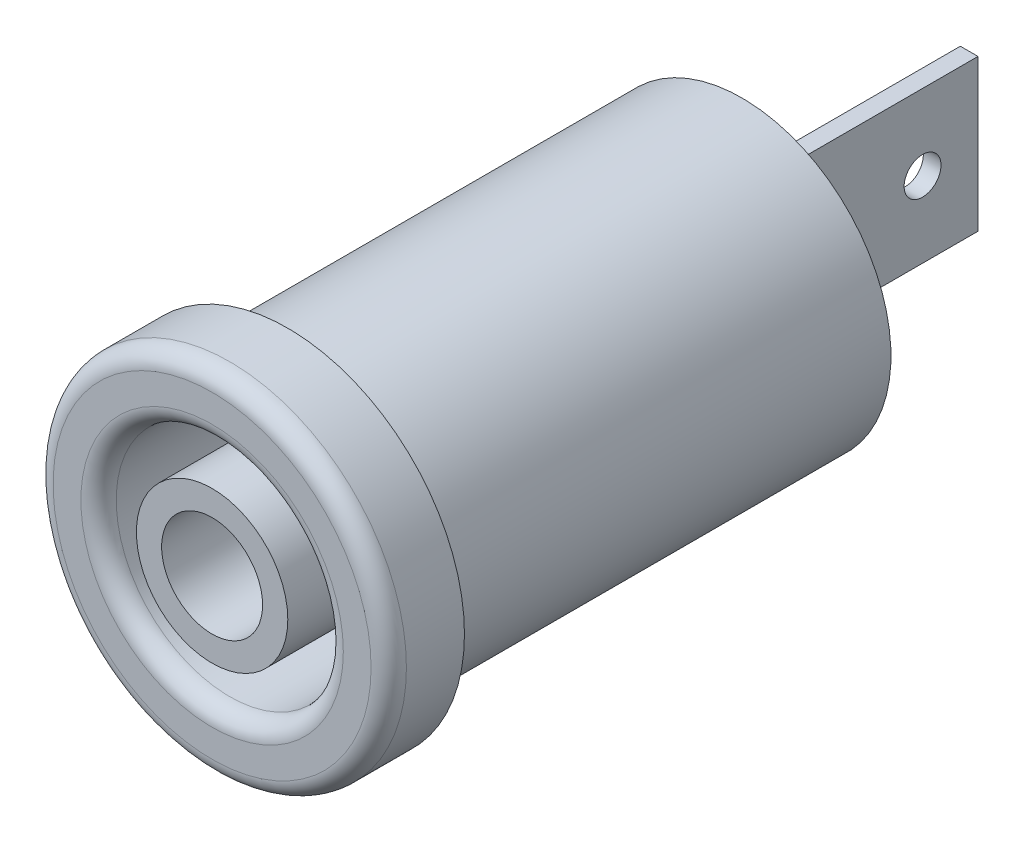
ISO-10303-21;
HEADER;
FILE_DESCRIPTION(('STEP AP214'),'2;1');
FILE_NAME('part.step','',(''),(''),'','','');
FILE_SCHEMA(('AUTOMOTIVE_DESIGN { 1 0 10303 214 1 1 1 1 }'));
ENDSEC;
DATA;
#1=APPLICATION_CONTEXT('core data for automotive mechanical design processes');
#2=APPLICATION_PROTOCOL_DEFINITION('international standard','automotive_design',2000,#1);
#3=PRODUCT_CONTEXT('',#1,'mechanical');
#4=PRODUCT('Part','Part','',(#3));
#5=PRODUCT_RELATED_PRODUCT_CATEGORY('part','',(#4));
#6=PRODUCT_DEFINITION_FORMATION('','',#4);
#7=PRODUCT_DEFINITION_CONTEXT('part definition',#1,'design');
#8=PRODUCT_DEFINITION('design','',#6,#7);
#9=PRODUCT_DEFINITION_SHAPE('','',#8);
#10=(LENGTH_UNIT() NAMED_UNIT(*) SI_UNIT(.MILLI.,.METRE.));
#11=(NAMED_UNIT(*) PLANE_ANGLE_UNIT() SI_UNIT($,.RADIAN.));
#12=(NAMED_UNIT(*) SI_UNIT($,.STERADIAN.) SOLID_ANGLE_UNIT());
#13=UNCERTAINTY_MEASURE_WITH_UNIT(LENGTH_MEASURE(1.E-05),#10,'distance_accuracy_value','');
#14=(GEOMETRIC_REPRESENTATION_CONTEXT(3) GLOBAL_UNCERTAINTY_ASSIGNED_CONTEXT((#13)) GLOBAL_UNIT_ASSIGNED_CONTEXT((#10,
#11,#12)) REPRESENTATION_CONTEXT('',''));
#15=CARTESIAN_POINT('',(0.,0.,0.));
#16=DIRECTION('',(0.,0.,1.));
#17=DIRECTION('',(1.,0.,0.));
#18=AXIS2_PLACEMENT_3D('',#15,#16,#17);
#19=CARTESIAN_POINT('',(0.,0.,-18.));
#20=DIRECTION('',(0.,0.,-1.));
#21=DIRECTION('',(-1.,0.,0.));
#22=AXIS2_PLACEMENT_3D('',#19,#20,#21);
#23=PLANE('',#22);
#24=CARTESIAN_POINT('',(0.,0.,-18.));
#25=DIRECTION('',(0.,0.,-1.));
#26=DIRECTION('',(-1.,0.,0.));
#27=AXIS2_PLACEMENT_3D('',#24,#25,#26);
#28=CIRCLE('',#27,5.9);
#29=CARTESIAN_POINT('',(-5.9,0.,-18.));
#30=VERTEX_POINT('',#29);
#31=EDGE_CURVE('E120',#30,#30,#28,.T.);
#32=ORIENTED_EDGE('',*,*,#31,.T.);
#33=EDGE_LOOP('',(#32));
#34=FACE_BOUND('',#33,.T.);
#35=DIRECTION('',(1.,0.,0.));
#36=VECTOR('',#35,1.);
#37=CARTESIAN_POINT('',(0.35,3.,-18.));
#38=LINE('',#37,#36);
#39=CARTESIAN_POINT('',(-0.35,3.,-18.));
#40=VERTEX_POINT('',#39);
#41=CARTESIAN_POINT('',(0.35,3.,-18.));
#42=VERTEX_POINT('',#41);
#43=EDGE_CURVE('E98',#40,#42,#38,.T.);
#44=ORIENTED_EDGE('',*,*,#43,.F.);
#45=DIRECTION('',(0.,1.,0.));
#46=VECTOR('',#45,1.);
#47=CARTESIAN_POINT('',(-0.35,3.,-18.));
#48=LINE('',#47,#46);
#49=CARTESIAN_POINT('',(-0.35,-3.,-18.));
#50=VERTEX_POINT('',#49);
#51=EDGE_CURVE('E109',#50,#40,#48,.T.);
#52=ORIENTED_EDGE('',*,*,#51,.F.);
#53=DIRECTION('',(-1.,0.,0.));
#54=VECTOR('',#53,1.);
#55=CARTESIAN_POINT('',(0.35,-3.,-18.));
#56=LINE('',#55,#54);
#57=CARTESIAN_POINT('',(0.35,-3.,-18.));
#58=VERTEX_POINT('',#57);
#59=EDGE_CURVE('E79',#58,#50,#56,.T.);
#60=ORIENTED_EDGE('',*,*,#59,.F.);
#61=DIRECTION('',(0.,-1.,0.));
#62=VECTOR('',#61,1.);
#63=CARTESIAN_POINT('',(0.35,3.,-18.));
#64=LINE('',#63,#62);
#65=EDGE_CURVE('E114',#42,#58,#64,.T.);
#66=ORIENTED_EDGE('',*,*,#65,.F.);
#67=EDGE_LOOP('',(#44,#52,#60,#66));
#68=FACE_BOUND('',#67,.T.);
#69=ADVANCED_FACE('F42',(#34,#68),#23,.T.);
#70=CARTESIAN_POINT('',(0.,0.,3.));
#71=DIRECTION('',(0.,0.,-1.));
#72=DIRECTION('',(-1.,0.,0.));
#73=AXIS2_PLACEMENT_3D('',#70,#71,#72);
#74=CYLINDRICAL_SURFACE('',#73,7.);
#75=CARTESIAN_POINT('',(0.,0.,2.3));
#76=DIRECTION('',(0.,0.,1.));
#77=DIRECTION('',(1.,0.,0.));
#78=AXIS2_PLACEMENT_3D('',#75,#76,#77);
#79=CIRCLE('',#78,7.);
#80=CARTESIAN_POINT('',(7.,0.,2.3));
#81=VERTEX_POINT('',#80);
#82=EDGE_CURVE('E11',#81,#81,#79,.F.);
#83=ORIENTED_EDGE('',*,*,#82,.T.);
#84=EDGE_LOOP('',(#83));
#85=FACE_BOUND('',#84,.T.);
#86=CARTESIAN_POINT('',(0.,0.,0.));
#87=DIRECTION('',(0.,0.,1.));
#88=DIRECTION('',(1.,0.,0.));
#89=AXIS2_PLACEMENT_3D('',#86,#87,#88);
#90=CIRCLE('',#89,7.);
#91=CARTESIAN_POINT('',(7.,0.,0.));
#92=VERTEX_POINT('',#91);
#93=EDGE_CURVE('E123',#92,#92,#90,.T.);
#94=ORIENTED_EDGE('',*,*,#93,.T.);
#95=EDGE_LOOP('',(#94));
#96=FACE_BOUND('',#95,.T.);
#97=ADVANCED_FACE('F187',(#85,#96),#74,.T.);
#98=CARTESIAN_POINT('',(0.,0.,3.));
#99=DIRECTION('',(0.,0.,1.));
#100=DIRECTION('',(1.,0.,0.));
#101=AXIS2_PLACEMENT_3D('',#98,#99,#100);
#102=PLANE('',#101);
#103=CARTESIAN_POINT('',(0.,0.,3.));
#104=DIRECTION('',(0.,0.,1.));
#105=DIRECTION('',(1.,0.,0.));
#106=AXIS2_PLACEMENT_3D('',#103,#104,#105);
#107=CIRCLE('',#106,5.2);
#108=CARTESIAN_POINT('',(5.2,0.,3.));
#109=VERTEX_POINT('',#108);
#110=EDGE_CURVE('E50',#109,#109,#107,.F.);
#111=ORIENTED_EDGE('',*,*,#110,.T.);
#112=EDGE_LOOP('',(#111));
#113=FACE_BOUND('',#112,.T.);
#114=CARTESIAN_POINT('',(0.,0.,3.));
#115=DIRECTION('',(0.,0.,1.));
#116=DIRECTION('',(1.,0.,0.));
#117=AXIS2_PLACEMENT_3D('',#114,#115,#116);
#118=CIRCLE('',#117,6.3);
#119=CARTESIAN_POINT('',(6.3,0.,3.));
#120=VERTEX_POINT('',#119);
#121=EDGE_CURVE('E132',#120,#120,#118,.T.);
#122=ORIENTED_EDGE('',*,*,#121,.T.);
#123=EDGE_LOOP('',(#122));
#124=FACE_BOUND('',#123,.T.);
#125=ADVANCED_FACE('F137',(#113,#124),#102,.T.);
#126=CARTESIAN_POINT('',(0.,0.,0.));
#127=DIRECTION('',(0.,0.,1.));
#128=DIRECTION('',(1.,0.,0.));
#129=AXIS2_PLACEMENT_3D('',#126,#127,#128);
#130=PLANE('',#129);
#131=CARTESIAN_POINT('',(0.,0.,0.));
#132=DIRECTION('',(0.,0.,-1.));
#133=DIRECTION('',(-1.,0.,0.));
#134=AXIS2_PLACEMENT_3D('',#131,#132,#133);
#135=CIRCLE('',#134,5.9);
#136=CARTESIAN_POINT('',(-5.9,0.,0.));
#137=VERTEX_POINT('',#136);
#138=EDGE_CURVE('E124',#137,#137,#135,.T.);
#139=ORIENTED_EDGE('',*,*,#138,.F.);
#140=EDGE_LOOP('',(#139));
#141=FACE_BOUND('',#140,.T.);
#142=ORIENTED_EDGE('',*,*,#93,.F.);
#143=EDGE_LOOP('',(#142));
#144=FACE_BOUND('',#143,.T.);
#145=ADVANCED_FACE('F201',(#141,#144),#130,.F.);
#146=CARTESIAN_POINT('',(0.,0.,-18.));
#147=DIRECTION('',(0.,0.,1.));
#148=DIRECTION('',(1.,0.,0.));
#149=AXIS2_PLACEMENT_3D('',#146,#147,#148);
#150=CYLINDRICAL_SURFACE('',#149,5.9);
#151=ORIENTED_EDGE('',*,*,#31,.F.);
#152=EDGE_LOOP('',(#151));
#153=FACE_BOUND('',#152,.T.);
#154=ORIENTED_EDGE('',*,*,#138,.T.);
#155=EDGE_LOOP('',(#154));
#156=FACE_BOUND('',#155,.T.);
#157=ADVANCED_FACE('F198',(#153,#156),#150,.T.);
#158=CARTESIAN_POINT('',(-0.35,3.,-27.));
#159=DIRECTION('',(1.,0.,0.));
#160=DIRECTION('',(0.,0.,-1.));
#161=AXIS2_PLACEMENT_3D('',#158,#159,#160);
#162=PLANE('',#161);
#163=CARTESIAN_POINT('',(-0.35,0.,-24.8027620544737));
#164=DIRECTION('',(1.,0.,0.));
#165=DIRECTION('',(0.,0.,-1.));
#166=AXIS2_PLACEMENT_3D('',#163,#164,#165);
#167=CIRCLE('',#166,0.730989372443443);
#168=CARTESIAN_POINT('',(-0.35,0.,-25.5337514269172));
#169=VERTEX_POINT('',#168);
#170=EDGE_CURVE('E112',#169,#169,#167,.T.);
#171=ORIENTED_EDGE('',*,*,#170,.T.);
#172=EDGE_LOOP('',(#171));
#173=FACE_BOUND('',#172,.T.);
#174=ORIENTED_EDGE('',*,*,#51,.T.);
#175=DIRECTION('',(0.,0.,1.));
#176=VECTOR('',#175,1.);
#177=CARTESIAN_POINT('',(-0.35,3.,-27.));
#178=LINE('',#177,#176);
#179=CARTESIAN_POINT('',(-0.35,3.,-27.));
#180=VERTEX_POINT('',#179);
#181=EDGE_CURVE('E101',#180,#40,#178,.T.);
#182=ORIENTED_EDGE('',*,*,#181,.F.);
#183=DIRECTION('',(0.,1.,0.));
#184=VECTOR('',#183,1.);
#185=CARTESIAN_POINT('',(-0.35,3.,-27.));
#186=LINE('',#185,#184);
#187=CARTESIAN_POINT('',(-0.35,-3.,-27.));
#188=VERTEX_POINT('',#187);
#189=EDGE_CURVE('E91',#188,#180,#186,.T.);
#190=ORIENTED_EDGE('',*,*,#189,.F.);
#191=DIRECTION('',(0.,0.,1.));
#192=VECTOR('',#191,1.);
#193=CARTESIAN_POINT('',(-0.35,-3.,-27.));
#194=LINE('',#193,#192);
#195=EDGE_CURVE('E105',#188,#50,#194,.T.);
#196=ORIENTED_EDGE('',*,*,#195,.T.);
#197=EDGE_LOOP('',(#174,#182,#190,#196));
#198=FACE_BOUND('',#197,.T.);
#199=ADVANCED_FACE('F169',(#173,#198),#162,.F.);
#200=CARTESIAN_POINT('',(0.35,3.,-27.));
#201=DIRECTION('',(0.,-1.,0.));
#202=DIRECTION('',(0.,0.,-1.));
#203=AXIS2_PLACEMENT_3D('',#200,#201,#202);
#204=PLANE('',#203);
#205=ORIENTED_EDGE('',*,*,#43,.T.);
#206=DIRECTION('',(0.,0.,1.));
#207=VECTOR('',#206,1.);
#208=CARTESIAN_POINT('',(0.35,3.,-27.));
#209=LINE('',#208,#207);
#210=CARTESIAN_POINT('',(0.35,3.,-27.));
#211=VERTEX_POINT('',#210);
#212=EDGE_CURVE('E95',#211,#42,#209,.T.);
#213=ORIENTED_EDGE('',*,*,#212,.F.);
#214=DIRECTION('',(1.,0.,0.));
#215=VECTOR('',#214,1.);
#216=CARTESIAN_POINT('',(0.35,3.,-27.));
#217=LINE('',#216,#215);
#218=EDGE_CURVE('E86',#180,#211,#217,.T.);
#219=ORIENTED_EDGE('',*,*,#218,.F.);
#220=ORIENTED_EDGE('',*,*,#181,.T.);
#221=EDGE_LOOP('',(#205,#213,#219,#220));
#222=FACE_BOUND('',#221,.T.);
#223=ADVANCED_FACE('F96',(#222),#204,.F.);
#224=CARTESIAN_POINT('',(0.35,3.,-27.));
#225=DIRECTION('',(-1.,0.,0.));
#226=DIRECTION('',(0.,0.,1.));
#227=AXIS2_PLACEMENT_3D('',#224,#225,#226);
#228=PLANE('',#227);
#229=CARTESIAN_POINT('',(0.35,0.,-24.8027620544737));
#230=DIRECTION('',(1.,0.,0.));
#231=DIRECTION('',(0.,0.,-1.));
#232=AXIS2_PLACEMENT_3D('',#229,#230,#231);
#233=CIRCLE('',#232,0.730989372443443);
#234=CARTESIAN_POINT('',(0.35,0.,-25.5337514269172));
#235=VERTEX_POINT('',#234);
#236=EDGE_CURVE('E156',#235,#235,#233,.T.);
#237=ORIENTED_EDGE('',*,*,#236,.F.);
#238=EDGE_LOOP('',(#237));
#239=FACE_BOUND('',#238,.T.);
#240=ORIENTED_EDGE('',*,*,#65,.T.);
#241=DIRECTION('',(0.,0.,1.));
#242=VECTOR('',#241,1.);
#243=CARTESIAN_POINT('',(0.35,-3.,-27.));
#244=LINE('',#243,#242);
#245=CARTESIAN_POINT('',(0.35,-3.,-27.));
#246=VERTEX_POINT('',#245);
#247=EDGE_CURVE('E57',#246,#58,#244,.T.);
#248=ORIENTED_EDGE('',*,*,#247,.F.);
#249=DIRECTION('',(0.,-1.,0.));
#250=VECTOR('',#249,1.);
#251=CARTESIAN_POINT('',(0.35,3.,-27.));
#252=LINE('',#251,#250);
#253=EDGE_CURVE('E89',#211,#246,#252,.T.);
#254=ORIENTED_EDGE('',*,*,#253,.F.);
#255=ORIENTED_EDGE('',*,*,#212,.T.);
#256=EDGE_LOOP('',(#240,#248,#254,#255));
#257=FACE_BOUND('',#256,.T.);
#258=ADVANCED_FACE('F103',(#239,#257),#228,.F.);
#259=CARTESIAN_POINT('',(0.35,-3.,-27.));
#260=DIRECTION('',(0.,1.,0.));
#261=DIRECTION('',(0.,0.,1.));
#262=AXIS2_PLACEMENT_3D('',#259,#260,#261);
#263=PLANE('',#262);
#264=ORIENTED_EDGE('',*,*,#59,.T.);
#265=ORIENTED_EDGE('',*,*,#195,.F.);
#266=DIRECTION('',(-1.,0.,0.));
#267=VECTOR('',#266,1.);
#268=CARTESIAN_POINT('',(0.35,-3.,-27.));
#269=LINE('',#268,#267);
#270=EDGE_CURVE('E65',#246,#188,#269,.T.);
#271=ORIENTED_EDGE('',*,*,#270,.F.);
#272=ORIENTED_EDGE('',*,*,#247,.T.);
#273=EDGE_LOOP('',(#264,#265,#271,#272));
#274=FACE_BOUND('',#273,.T.);
#275=ADVANCED_FACE('F178',(#274),#263,.F.);
#276=CARTESIAN_POINT('',(0.,0.,-27.));
#277=DIRECTION('',(0.,0.,-1.));
#278=DIRECTION('',(-1.,0.,0.));
#279=AXIS2_PLACEMENT_3D('',#276,#277,#278);
#280=PLANE('',#279);
#281=ORIENTED_EDGE('',*,*,#189,.T.);
#282=ORIENTED_EDGE('',*,*,#218,.T.);
#283=ORIENTED_EDGE('',*,*,#253,.T.);
#284=ORIENTED_EDGE('',*,*,#270,.T.);
#285=EDGE_LOOP('',(#281,#282,#283,#284));
#286=FACE_BOUND('',#285,.T.);
#287=ADVANCED_FACE('F87',(#286),#280,.T.);
#288=CARTESIAN_POINT('',(-0.35,0.,-24.8027620544737));
#289=DIRECTION('',(1.,0.,0.));
#290=DIRECTION('',(0.,0.,-1.));
#291=AXIS2_PLACEMENT_3D('',#288,#289,#290);
#292=CYLINDRICAL_SURFACE('',#291,0.730989372443443);
#293=ORIENTED_EDGE('',*,*,#170,.F.);
#294=EDGE_LOOP('',(#293));
#295=FACE_BOUND('',#294,.T.);
#296=ORIENTED_EDGE('',*,*,#236,.T.);
#297=EDGE_LOOP('',(#296));
#298=FACE_BOUND('',#297,.T.);
#299=ADVANCED_FACE('F150',(#295,#298),#292,.F.);
#300=CARTESIAN_POINT('',(0.,0.,-7.));
#301=DIRECTION('',(0.,0.,1.));
#302=DIRECTION('',(1.,0.,0.));
#303=AXIS2_PLACEMENT_3D('',#300,#301,#302);
#304=CYLINDRICAL_SURFACE('',#303,4.5);
#305=CARTESIAN_POINT('',(0.,0.,2.3));
#306=DIRECTION('',(0.,0.,1.));
#307=DIRECTION('',(1.,0.,0.));
#308=AXIS2_PLACEMENT_3D('',#305,#306,#307);
#309=CIRCLE('',#308,4.5);
#310=CARTESIAN_POINT('',(4.5,0.,2.3));
#311=VERTEX_POINT('',#310);
#312=EDGE_CURVE('E127',#311,#311,#309,.T.);
#313=ORIENTED_EDGE('',*,*,#312,.T.);
#314=EDGE_LOOP('',(#313));
#315=FACE_BOUND('',#314,.T.);
#316=CARTESIAN_POINT('',(0.,0.,-7.));
#317=DIRECTION('',(0.,0.,1.));
#318=DIRECTION('',(1.,0.,0.));
#319=AXIS2_PLACEMENT_3D('',#316,#317,#318);
#320=CIRCLE('',#319,4.5);
#321=CARTESIAN_POINT('',(4.5,0.,-7.));
#322=VERTEX_POINT('',#321);
#323=EDGE_CURVE('E154',#322,#322,#320,.T.);
#324=ORIENTED_EDGE('',*,*,#323,.F.);
#325=EDGE_LOOP('',(#324));
#326=FACE_BOUND('',#325,.T.);
#327=ADVANCED_FACE('F146',(#315,#326),#304,.F.);
#328=CARTESIAN_POINT('',(0.,0.,-7.));
#329=DIRECTION('',(0.,0.,1.));
#330=DIRECTION('',(1.,0.,0.));
#331=AXIS2_PLACEMENT_3D('',#328,#329,#330);
#332=PLANE('',#331);
#333=CARTESIAN_POINT('',(0.,0.,-7.));
#334=DIRECTION('',(0.,0.,1.));
#335=DIRECTION('',(1.,0.,0.));
#336=AXIS2_PLACEMENT_3D('',#333,#334,#335);
#337=CIRCLE('',#336,3.);
#338=CARTESIAN_POINT('',(3.,0.,-7.));
#339=VERTEX_POINT('',#338);
#340=EDGE_CURVE('E162',#339,#339,#337,.T.);
#341=ORIENTED_EDGE('',*,*,#340,.F.);
#342=EDGE_LOOP('',(#341));
#343=FACE_BOUND('',#342,.T.);
#344=ORIENTED_EDGE('',*,*,#323,.T.);
#345=EDGE_LOOP('',(#344));
#346=FACE_BOUND('',#345,.T.);
#347=ADVANCED_FACE('F149',(#343,#346),#332,.T.);
#348=CARTESIAN_POINT('',(0.,0.,3.));
#349=DIRECTION('',(0.,0.,-1.));
#350=DIRECTION('',(-1.,0.,0.));
#351=AXIS2_PLACEMENT_3D('',#348,#349,#350);
#352=CYLINDRICAL_SURFACE('',#351,3.);
#353=CARTESIAN_POINT('',(0.,0.,3.));
#354=DIRECTION('',(0.,0.,1.));
#355=DIRECTION('',(1.,0.,0.));
#356=AXIS2_PLACEMENT_3D('',#353,#354,#355);
#357=CIRCLE('',#356,3.);
#358=CARTESIAN_POINT('',(3.,0.,3.));
#359=VERTEX_POINT('',#358);
#360=EDGE_CURVE('E157',#359,#359,#357,.T.);
#361=ORIENTED_EDGE('',*,*,#360,.F.);
#362=EDGE_LOOP('',(#361));
#363=FACE_BOUND('',#362,.T.);
#364=ORIENTED_EDGE('',*,*,#340,.T.);
#365=EDGE_LOOP('',(#364));
#366=FACE_BOUND('',#365,.T.);
#367=ADVANCED_FACE('F263',(#363,#366),#352,.T.);
#368=CARTESIAN_POINT('',(0.,0.,3.));
#369=DIRECTION('',(0.,0.,1.));
#370=DIRECTION('',(1.,0.,0.));
#371=AXIS2_PLACEMENT_3D('',#368,#369,#370);
#372=PLANE('',#371);
#373=CARTESIAN_POINT('',(0.,0.,3.));
#374=DIRECTION('',(0.,0.,1.));
#375=DIRECTION('',(1.,0.,0.));
#376=AXIS2_PLACEMENT_3D('',#373,#374,#375);
#377=CIRCLE('',#376,2.);
#378=CARTESIAN_POINT('',(2.,0.,3.));
#379=VERTEX_POINT('',#378);
#380=EDGE_CURVE('E349',#379,#379,#377,.T.);
#381=ORIENTED_EDGE('',*,*,#380,.F.);
#382=EDGE_LOOP('',(#381));
#383=FACE_BOUND('',#382,.T.);
#384=ORIENTED_EDGE('',*,*,#360,.T.);
#385=EDGE_LOOP('',(#384));
#386=FACE_BOUND('',#385,.T.);
#387=ADVANCED_FACE('F271',(#383,#386),#372,.T.);
#388=CARTESIAN_POINT('',(0.,0.,-7.));
#389=DIRECTION('',(0.,0.,1.));
#390=DIRECTION('',(1.,0.,0.));
#391=AXIS2_PLACEMENT_3D('',#388,#389,#390);
#392=CYLINDRICAL_SURFACE('',#391,2.);
#393=CARTESIAN_POINT('',(0.,0.,-7.));
#394=DIRECTION('',(0.,0.,1.));
#395=DIRECTION('',(1.,0.,0.));
#396=AXIS2_PLACEMENT_3D('',#393,#394,#395);
#397=CIRCLE('',#396,2.);
#398=CARTESIAN_POINT('',(2.,0.,-7.));
#399=VERTEX_POINT('',#398);
#400=EDGE_CURVE('E348',#399,#399,#397,.T.);
#401=ORIENTED_EDGE('',*,*,#400,.F.);
#402=EDGE_LOOP('',(#401));
#403=FACE_BOUND('',#402,.T.);
#404=ORIENTED_EDGE('',*,*,#380,.T.);
#405=EDGE_LOOP('',(#404));
#406=FACE_BOUND('',#405,.T.);
#407=ADVANCED_FACE('F279',(#403,#406),#392,.F.);
#408=CARTESIAN_POINT('',(0.,0.,-7.));
#409=DIRECTION('',(0.,0.,1.));
#410=DIRECTION('',(1.,0.,0.));
#411=AXIS2_PLACEMENT_3D('',#408,#409,#410);
#412=PLANE('',#411);
#413=ORIENTED_EDGE('',*,*,#400,.T.);
#414=EDGE_LOOP('',(#413));
#415=FACE_BOUND('',#414,.T.);
#416=ADVANCED_FACE('F143',(#415),#412,.T.);
#417=CARTESIAN_POINT('',(0.,0.,2.3));
#418=DIRECTION('',(0.,0.,1.));
#419=DIRECTION('',(1.,0.,0.));
#420=AXIS2_PLACEMENT_3D('',#417,#418,#419);
#421=TOROIDAL_SURFACE('',#420,5.2,0.7);
#422=ORIENTED_EDGE('',*,*,#110,.F.);
#423=EDGE_LOOP('',(#422));
#424=FACE_BOUND('',#423,.T.);
#425=ORIENTED_EDGE('',*,*,#312,.F.);
#426=EDGE_LOOP('',(#425));
#427=FACE_BOUND('',#426,.T.);
#428=ADVANCED_FACE('F140',(#424,#427),#421,.T.);
#429=CARTESIAN_POINT('',(0.,0.,2.3));
#430=DIRECTION('',(0.,0.,1.));
#431=DIRECTION('',(1.,0.,0.));
#432=AXIS2_PLACEMENT_3D('',#429,#430,#431);
#433=TOROIDAL_SURFACE('',#432,6.3,0.7);
#434=ORIENTED_EDGE('',*,*,#82,.F.);
#435=EDGE_LOOP('',(#434));
#436=FACE_BOUND('',#435,.T.);
#437=ORIENTED_EDGE('',*,*,#121,.F.);
#438=EDGE_LOOP('',(#437));
#439=FACE_BOUND('',#438,.T.);
#440=ADVANCED_FACE('F44',(#436,#439),#433,.T.);
#441=CLOSED_SHELL('',(#69,#97,#125,#145,#157,#199,#223,#258,#275,#287,#299,#327,#347,#367,#387,
#407,#416,#428,#440));
#442=MANIFOLD_SOLID_BREP('B2',#441);
#443=ADVANCED_BREP_SHAPE_REPRESENTATION('',(#18,#442),#14);
#444=SHAPE_DEFINITION_REPRESENTATION(#9,#443);
ENDSEC;
END-ISO-10303-21;
